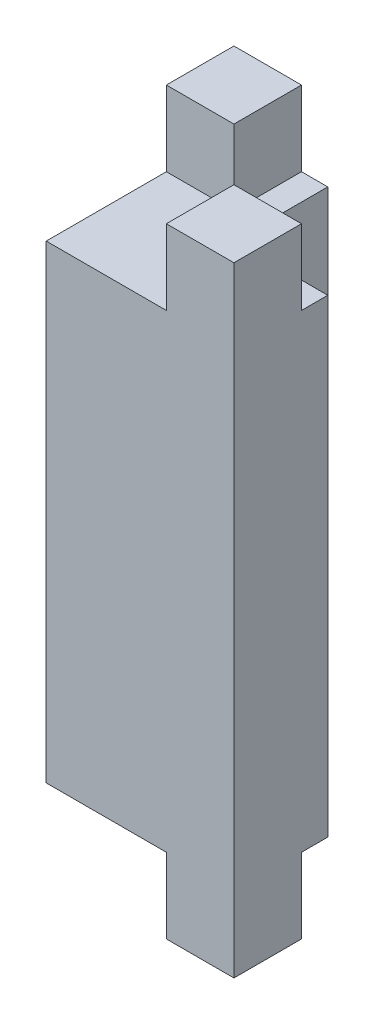
ISO-10303-21;
HEADER;
FILE_DESCRIPTION(('STEP AP214'),'2;1');
FILE_NAME('part.step','',(''),(''),'','','');
FILE_SCHEMA(('AUTOMOTIVE_DESIGN { 1 0 10303 214 1 1 1 1 }'));
ENDSEC;
DATA;
#1=APPLICATION_CONTEXT('core data for automotive mechanical design processes');
#2=APPLICATION_PROTOCOL_DEFINITION('international standard','automotive_design',2000,#1);
#3=PRODUCT_CONTEXT('',#1,'mechanical');
#4=PRODUCT('Part','Part','',(#3));
#5=PRODUCT_RELATED_PRODUCT_CATEGORY('part','',(#4));
#6=PRODUCT_DEFINITION_FORMATION('','',#4);
#7=PRODUCT_DEFINITION_CONTEXT('part definition',#1,'design');
#8=PRODUCT_DEFINITION('design','',#6,#7);
#9=PRODUCT_DEFINITION_SHAPE('','',#8);
#10=(LENGTH_UNIT() NAMED_UNIT(*) SI_UNIT(.MILLI.,.METRE.));
#11=(NAMED_UNIT(*) PLANE_ANGLE_UNIT() SI_UNIT($,.RADIAN.));
#12=(NAMED_UNIT(*) SI_UNIT($,.STERADIAN.) SOLID_ANGLE_UNIT());
#13=UNCERTAINTY_MEASURE_WITH_UNIT(LENGTH_MEASURE(1.E-05),#10,'distance_accuracy_value','');
#14=(GEOMETRIC_REPRESENTATION_CONTEXT(3) GLOBAL_UNCERTAINTY_ASSIGNED_CONTEXT((#13)) GLOBAL_UNIT_ASSIGNED_CONTEXT((#10,
#11,#12)) REPRESENTATION_CONTEXT('',''));
#15=CARTESIAN_POINT('',(0.,0.,0.));
#16=DIRECTION('',(0.,0.,1.));
#17=DIRECTION('',(1.,0.,0.));
#18=AXIS2_PLACEMENT_3D('',#15,#16,#17);
#19=CARTESIAN_POINT('',(0.,25.,0.));
#20=DIRECTION('',(0.,-1.,0.));
#21=DIRECTION('',(0.,0.,-1.));
#22=AXIS2_PLACEMENT_3D('',#19,#20,#21);
#23=PLANE('',#22);
#24=DIRECTION('',(-1.,0.,0.));
#25=VECTOR('',#24,1.);
#26=CARTESIAN_POINT('',(5.,25.,1.4));
#27=LINE('',#26,#25);
#28=CARTESIAN_POINT('',(5.,25.,1.4));
#29=VERTEX_POINT('',#28);
#30=CARTESIAN_POINT('',(1.4,25.,1.4));
#31=VERTEX_POINT('',#30);
#32=EDGE_CURVE('E181',#29,#31,#27,.T.);
#33=ORIENTED_EDGE('',*,*,#32,.F.);
#34=DIRECTION('',(0.,0.,-1.));
#35=VECTOR('',#34,1.);
#36=CARTESIAN_POINT('',(5.,25.,5.));
#37=LINE('',#36,#35);
#38=CARTESIAN_POINT('',(5.,25.,0.));
#39=VERTEX_POINT('',#38);
#40=EDGE_CURVE('E170',#29,#39,#37,.T.);
#41=ORIENTED_EDGE('',*,*,#40,.T.);
#42=DIRECTION('',(-1.,0.,0.));
#43=VECTOR('',#42,1.);
#44=CARTESIAN_POINT('',(0.,25.,0.));
#45=LINE('',#44,#43);
#46=CARTESIAN_POINT('',(0.,25.,0.));
#47=VERTEX_POINT('',#46);
#48=EDGE_CURVE('E179',#39,#47,#45,.T.);
#49=ORIENTED_EDGE('',*,*,#48,.T.);
#50=DIRECTION('',(0.,0.,-1.));
#51=VECTOR('',#50,1.);
#52=CARTESIAN_POINT('',(0.,25.,0.));
#53=LINE('',#52,#51);
#54=CARTESIAN_POINT('',(0.,25.,-5.));
#55=VERTEX_POINT('',#54);
#56=EDGE_CURVE('E325',#47,#55,#53,.T.);
#57=ORIENTED_EDGE('',*,*,#56,.T.);
#58=DIRECTION('',(-1.,0.,0.));
#59=VECTOR('',#58,1.);
#60=CARTESIAN_POINT('',(-5.,25.,-5.));
#61=LINE('',#60,#59);
#62=CARTESIAN_POINT('',(-1.4,25.,-5.));
#63=VERTEX_POINT('',#62);
#64=EDGE_CURVE('E328',#55,#63,#61,.T.);
#65=ORIENTED_EDGE('',*,*,#64,.T.);
#66=DIRECTION('',(0.,0.,-1.));
#67=VECTOR('',#66,1.);
#68=CARTESIAN_POINT('',(-1.4,25.,-5.));
#69=LINE('',#68,#67);
#70=CARTESIAN_POINT('',(-1.4,25.,-1.4));
#71=VERTEX_POINT('',#70);
#72=EDGE_CURVE('E186',#71,#63,#69,.T.);
#73=ORIENTED_EDGE('',*,*,#72,.F.);
#74=DIRECTION('',(1.,0.,0.));
#75=VECTOR('',#74,1.);
#76=CARTESIAN_POINT('',(-1.4,25.,-1.4));
#77=LINE('',#76,#75);
#78=CARTESIAN_POINT('',(-5.,25.,-1.4));
#79=VERTEX_POINT('',#78);
#80=EDGE_CURVE('E220',#79,#71,#77,.T.);
#81=ORIENTED_EDGE('',*,*,#80,.F.);
#82=DIRECTION('',(0.,0.,1.));
#83=VECTOR('',#82,1.);
#84=CARTESIAN_POINT('',(-5.,25.,5.));
#85=LINE('',#84,#83);
#86=CARTESIAN_POINT('',(-5.,25.,5.));
#87=VERTEX_POINT('',#86);
#88=EDGE_CURVE('E317',#79,#87,#85,.T.);
#89=ORIENTED_EDGE('',*,*,#88,.T.);
#90=DIRECTION('',(1.,0.,0.));
#91=VECTOR('',#90,1.);
#92=CARTESIAN_POINT('',(-5.,25.,5.));
#93=LINE('',#92,#91);
#94=CARTESIAN_POINT('',(1.4,25.,5.));
#95=VERTEX_POINT('',#94);
#96=EDGE_CURVE('E66',#87,#95,#93,.T.);
#97=ORIENTED_EDGE('',*,*,#96,.T.);
#98=DIRECTION('',(0.,0.,1.));
#99=VECTOR('',#98,1.);
#100=CARTESIAN_POINT('',(1.4,25.,1.4));
#101=LINE('',#100,#99);
#102=EDGE_CURVE('E61',#31,#95,#101,.T.);
#103=ORIENTED_EDGE('',*,*,#102,.F.);
#104=EDGE_LOOP('',(#33,#41,#49,#57,#65,#73,#81,#89,#97,#103));
#105=FACE_BOUND('',#104,.T.);
#106=ADVANCED_FACE('F45',(#105),#23,.F.);
#107=CARTESIAN_POINT('',(0.,0.,0.));
#108=DIRECTION('',(0.,-1.,0.));
#109=DIRECTION('',(0.,0.,-1.));
#110=AXIS2_PLACEMENT_3D('',#107,#108,#109);
#111=PLANE('',#110);
#112=DIRECTION('',(0.,0.,1.));
#113=VECTOR('',#112,1.);
#114=CARTESIAN_POINT('',(1.4,0.,1.4));
#115=LINE('',#114,#113);
#116=CARTESIAN_POINT('',(1.4,0.,1.4));
#117=VERTEX_POINT('',#116);
#118=CARTESIAN_POINT('',(1.4,0.,5.));
#119=VERTEX_POINT('',#118);
#120=EDGE_CURVE('E259',#117,#119,#115,.T.);
#121=ORIENTED_EDGE('',*,*,#120,.T.);
#122=DIRECTION('',(1.,0.,0.));
#123=VECTOR('',#122,1.);
#124=CARTESIAN_POINT('',(-5.,0.,5.));
#125=LINE('',#124,#123);
#126=CARTESIAN_POINT('',(-5.,0.,5.));
#127=VERTEX_POINT('',#126);
#128=EDGE_CURVE('E311',#127,#119,#125,.T.);
#129=ORIENTED_EDGE('',*,*,#128,.F.);
#130=DIRECTION('',(0.,0.,1.));
#131=VECTOR('',#130,1.);
#132=CARTESIAN_POINT('',(-5.,0.,0.));
#133=LINE('',#132,#131);
#134=CARTESIAN_POINT('',(-5.,0.,-1.4));
#135=VERTEX_POINT('',#134);
#136=EDGE_CURVE('E320',#135,#127,#133,.T.);
#137=ORIENTED_EDGE('',*,*,#136,.F.);
#138=DIRECTION('',(1.,0.,0.));
#139=VECTOR('',#138,1.);
#140=CARTESIAN_POINT('',(-1.4,0.,-1.40000000000001));
#141=LINE('',#140,#139);
#142=CARTESIAN_POINT('',(-1.4,0.,-1.40000000000001));
#143=VERTEX_POINT('',#142);
#144=EDGE_CURVE('E288',#135,#143,#141,.T.);
#145=ORIENTED_EDGE('',*,*,#144,.T.);
#146=DIRECTION('',(0.,0.,-1.));
#147=VECTOR('',#146,1.);
#148=CARTESIAN_POINT('',(-1.4,0.,-5.));
#149=LINE('',#148,#147);
#150=CARTESIAN_POINT('',(-1.4,0.,-5.));
#151=VERTEX_POINT('',#150);
#152=EDGE_CURVE('E268',#143,#151,#149,.T.);
#153=ORIENTED_EDGE('',*,*,#152,.T.);
#154=DIRECTION('',(-1.,0.,0.));
#155=VECTOR('',#154,1.);
#156=CARTESIAN_POINT('',(-5.,0.,-5.));
#157=LINE('',#156,#155);
#158=CARTESIAN_POINT('',(0.,0.,-5.));
#159=VERTEX_POINT('',#158);
#160=EDGE_CURVE('E344',#159,#151,#157,.T.);
#161=ORIENTED_EDGE('',*,*,#160,.F.);
#162=DIRECTION('',(0.,0.,-1.));
#163=VECTOR('',#162,1.);
#164=CARTESIAN_POINT('',(0.,0.,0.));
#165=LINE('',#164,#163);
#166=CARTESIAN_POINT('',(0.,0.,0.));
#167=VERTEX_POINT('',#166);
#168=EDGE_CURVE('E341',#167,#159,#165,.T.);
#169=ORIENTED_EDGE('',*,*,#168,.F.);
#170=DIRECTION('',(-1.,0.,0.));
#171=VECTOR('',#170,1.);
#172=CARTESIAN_POINT('',(0.,0.,0.));
#173=LINE('',#172,#171);
#174=CARTESIAN_POINT('',(5.,0.,0.));
#175=VERTEX_POINT('',#174);
#176=EDGE_CURVE('E338',#175,#167,#173,.T.);
#177=ORIENTED_EDGE('',*,*,#176,.F.);
#178=DIRECTION('',(0.,0.,-1.));
#179=VECTOR('',#178,1.);
#180=CARTESIAN_POINT('',(5.,0.,5.));
#181=LINE('',#180,#179);
#182=CARTESIAN_POINT('',(5.,0.,1.4));
#183=VERTEX_POINT('',#182);
#184=EDGE_CURVE('E335',#183,#175,#181,.T.);
#185=ORIENTED_EDGE('',*,*,#184,.F.);
#186=DIRECTION('',(-1.,0.,0.));
#187=VECTOR('',#186,1.);
#188=CARTESIAN_POINT('',(5.,0.,1.4));
#189=LINE('',#188,#187);
#190=EDGE_CURVE('E263',#183,#117,#189,.T.);
#191=ORIENTED_EDGE('',*,*,#190,.T.);
#192=EDGE_LOOP('',(#121,#129,#137,#145,#153,#161,#169,#177,#185,#191));
#193=FACE_BOUND('',#192,.T.);
#194=ADVANCED_FACE('F379',(#193),#111,.T.);
#195=CARTESIAN_POINT('',(-5.,25.,5.));
#196=DIRECTION('',(0.,0.,-1.));
#197=DIRECTION('',(-1.,0.,0.));
#198=AXIS2_PLACEMENT_3D('',#195,#196,#197);
#199=PLANE('',#198);
#200=ORIENTED_EDGE('',*,*,#128,.T.);
#201=DIRECTION('',(0.,1.,0.));
#202=VECTOR('',#201,1.);
#203=CARTESIAN_POINT('',(1.4,-4.,5.));
#204=LINE('',#203,#202);
#205=CARTESIAN_POINT('',(1.4,-4.,5.));
#206=VERTEX_POINT('',#205);
#207=EDGE_CURVE('E248',#206,#119,#204,.T.);
#208=ORIENTED_EDGE('',*,*,#207,.F.);
#209=DIRECTION('',(1.,0.,0.));
#210=VECTOR('',#209,1.);
#211=CARTESIAN_POINT('',(5.,-4.,5.));
#212=LINE('',#211,#210);
#213=CARTESIAN_POINT('',(5.,-4.,5.));
#214=VERTEX_POINT('',#213);
#215=EDGE_CURVE('E253',#206,#214,#212,.T.);
#216=ORIENTED_EDGE('',*,*,#215,.T.);
#217=DIRECTION('',(0.,-1.,0.));
#218=VECTOR('',#217,1.);
#219=CARTESIAN_POINT('',(5.,25.,5.));
#220=LINE('',#219,#218);
#221=CARTESIAN_POINT('',(5.,29.,5.));
#222=VERTEX_POINT('',#221);
#223=EDGE_CURVE('E54',#222,#214,#220,.T.);
#224=ORIENTED_EDGE('',*,*,#223,.F.);
#225=DIRECTION('',(1.,0.,0.));
#226=VECTOR('',#225,1.);
#227=CARTESIAN_POINT('',(5.,29.,5.));
#228=LINE('',#227,#226);
#229=CARTESIAN_POINT('',(1.4,29.,5.00000000000001));
#230=VERTEX_POINT('',#229);
#231=EDGE_CURVE('E201',#230,#222,#228,.T.);
#232=ORIENTED_EDGE('',*,*,#231,.F.);
#233=DIRECTION('',(0.,-1.,0.));
#234=VECTOR('',#233,1.);
#235=CARTESIAN_POINT('',(1.4,29.,5.00000000000001));
#236=LINE('',#235,#234);
#237=EDGE_CURVE('E195',#230,#95,#236,.T.);
#238=ORIENTED_EDGE('',*,*,#237,.T.);
#239=ORIENTED_EDGE('',*,*,#96,.F.);
#240=DIRECTION('',(0.,-1.,0.));
#241=VECTOR('',#240,1.);
#242=CARTESIAN_POINT('',(-5.,25.,5.));
#243=LINE('',#242,#241);
#244=EDGE_CURVE('E11',#87,#127,#243,.T.);
#245=ORIENTED_EDGE('',*,*,#244,.T.);
#246=EDGE_LOOP('',(#200,#208,#216,#224,#232,#238,#239,#245));
#247=FACE_BOUND('',#246,.T.);
#248=ADVANCED_FACE('F47',(#247),#199,.F.);
#249=CARTESIAN_POINT('',(5.,25.,5.));
#250=DIRECTION('',(-1.,0.,0.));
#251=DIRECTION('',(0.,0.,1.));
#252=AXIS2_PLACEMENT_3D('',#249,#250,#251);
#253=PLANE('',#252);
#254=ORIENTED_EDGE('',*,*,#223,.T.);
#255=DIRECTION('',(0.,0.,-1.));
#256=VECTOR('',#255,1.);
#257=CARTESIAN_POINT('',(5.,-4.,1.4));
#258=LINE('',#257,#256);
#259=CARTESIAN_POINT('',(5.,-4.,1.4));
#260=VERTEX_POINT('',#259);
#261=EDGE_CURVE('E264',#214,#260,#258,.T.);
#262=ORIENTED_EDGE('',*,*,#261,.T.);
#263=DIRECTION('',(0.,1.,0.));
#264=VECTOR('',#263,1.);
#265=CARTESIAN_POINT('',(5.,-4.,1.4));
#266=LINE('',#265,#264);
#267=EDGE_CURVE('E249',#260,#183,#266,.T.);
#268=ORIENTED_EDGE('',*,*,#267,.T.);
#269=ORIENTED_EDGE('',*,*,#184,.T.);
#270=DIRECTION('',(0.,-1.,0.));
#271=VECTOR('',#270,1.);
#272=CARTESIAN_POINT('',(5.,25.,0.));
#273=LINE('',#272,#271);
#274=EDGE_CURVE('E176',#39,#175,#273,.T.);
#275=ORIENTED_EDGE('',*,*,#274,.F.);
#276=ORIENTED_EDGE('',*,*,#40,.F.);
#277=DIRECTION('',(0.,-1.,0.));
#278=VECTOR('',#277,1.);
#279=CARTESIAN_POINT('',(5.,29.,1.4));
#280=LINE('',#279,#278);
#281=CARTESIAN_POINT('',(5.,29.,1.4));
#282=VERTEX_POINT('',#281);
#283=EDGE_CURVE('E174',#282,#29,#280,.T.);
#284=ORIENTED_EDGE('',*,*,#283,.F.);
#285=DIRECTION('',(0.,0.,-1.));
#286=VECTOR('',#285,1.);
#287=CARTESIAN_POINT('',(5.,29.,1.4));
#288=LINE('',#287,#286);
#289=EDGE_CURVE('E203',#222,#282,#288,.T.);
#290=ORIENTED_EDGE('',*,*,#289,.F.);
#291=EDGE_LOOP('',(#254,#262,#268,#269,#275,#276,#284,#290));
#292=FACE_BOUND('',#291,.T.);
#293=ADVANCED_FACE('F171',(#292),#253,.F.);
#294=CARTESIAN_POINT('',(0.,25.,0.));
#295=DIRECTION('',(0.,0.,1.));
#296=DIRECTION('',(1.,0.,0.));
#297=AXIS2_PLACEMENT_3D('',#294,#295,#296);
#298=PLANE('',#297);
#299=ORIENTED_EDGE('',*,*,#176,.T.);
#300=DIRECTION('',(0.,-1.,0.));
#301=VECTOR('',#300,1.);
#302=CARTESIAN_POINT('',(0.,25.,0.));
#303=LINE('',#302,#301);
#304=EDGE_CURVE('E356',#47,#167,#303,.T.);
#305=ORIENTED_EDGE('',*,*,#304,.F.);
#306=ORIENTED_EDGE('',*,*,#48,.F.);
#307=ORIENTED_EDGE('',*,*,#274,.T.);
#308=EDGE_LOOP('',(#299,#305,#306,#307));
#309=FACE_BOUND('',#308,.T.);
#310=ADVANCED_FACE('F384',(#309),#298,.F.);
#311=CARTESIAN_POINT('',(0.,25.,0.));
#312=DIRECTION('',(-1.,0.,0.));
#313=DIRECTION('',(0.,0.,1.));
#314=AXIS2_PLACEMENT_3D('',#311,#312,#313);
#315=PLANE('',#314);
#316=ORIENTED_EDGE('',*,*,#168,.T.);
#317=DIRECTION('',(0.,-1.,0.));
#318=VECTOR('',#317,1.);
#319=CARTESIAN_POINT('',(0.,25.,-5.));
#320=LINE('',#319,#318);
#321=EDGE_CURVE('E352',#55,#159,#320,.T.);
#322=ORIENTED_EDGE('',*,*,#321,.F.);
#323=ORIENTED_EDGE('',*,*,#56,.F.);
#324=ORIENTED_EDGE('',*,*,#304,.T.);
#325=EDGE_LOOP('',(#316,#322,#323,#324));
#326=FACE_BOUND('',#325,.T.);
#327=ADVANCED_FACE('F387',(#326),#315,.F.);
#328=CARTESIAN_POINT('',(-5.,25.,-5.));
#329=DIRECTION('',(0.,0.,1.));
#330=DIRECTION('',(1.,0.,0.));
#331=AXIS2_PLACEMENT_3D('',#328,#329,#330);
#332=PLANE('',#331);
#333=ORIENTED_EDGE('',*,*,#160,.T.);
#334=DIRECTION('',(0.,1.,0.));
#335=VECTOR('',#334,1.);
#336=CARTESIAN_POINT('',(-1.4,-4.,-5.));
#337=LINE('',#336,#335);
#338=CARTESIAN_POINT('',(-1.4,-4.,-5.));
#339=VERTEX_POINT('',#338);
#340=EDGE_CURVE('E300',#339,#151,#337,.T.);
#341=ORIENTED_EDGE('',*,*,#340,.F.);
#342=DIRECTION('',(-1.,0.,0.));
#343=VECTOR('',#342,1.);
#344=CARTESIAN_POINT('',(-1.4,-4.,-5.));
#345=LINE('',#344,#343);
#346=CARTESIAN_POINT('',(-5.,-4.,-5.));
#347=VERTEX_POINT('',#346);
#348=EDGE_CURVE('E287',#339,#347,#345,.T.);
#349=ORIENTED_EDGE('',*,*,#348,.T.);
#350=DIRECTION('',(0.,-1.,0.));
#351=VECTOR('',#350,1.);
#352=CARTESIAN_POINT('',(-5.,25.,-5.));
#353=LINE('',#352,#351);
#354=CARTESIAN_POINT('',(-5.,29.,-5.));
#355=VERTEX_POINT('',#354);
#356=EDGE_CURVE('E331',#355,#347,#353,.T.);
#357=ORIENTED_EDGE('',*,*,#356,.F.);
#358=DIRECTION('',(-1.,0.,0.));
#359=VECTOR('',#358,1.);
#360=CARTESIAN_POINT('',(-1.4,29.,-5.));
#361=LINE('',#360,#359);
#362=CARTESIAN_POINT('',(-1.4,29.,-5.));
#363=VERTEX_POINT('',#362);
#364=EDGE_CURVE('E219',#363,#355,#361,.T.);
#365=ORIENTED_EDGE('',*,*,#364,.F.);
#366=DIRECTION('',(0.,-1.,0.));
#367=VECTOR('',#366,1.);
#368=CARTESIAN_POINT('',(-1.4,29.,-5.));
#369=LINE('',#368,#367);
#370=EDGE_CURVE('E244',#363,#63,#369,.T.);
#371=ORIENTED_EDGE('',*,*,#370,.T.);
#372=ORIENTED_EDGE('',*,*,#64,.F.);
#373=ORIENTED_EDGE('',*,*,#321,.T.);
#374=EDGE_LOOP('',(#333,#341,#349,#357,#365,#371,#372,#373));
#375=FACE_BOUND('',#374,.T.);
#376=ADVANCED_FACE('F392',(#375),#332,.F.);
#377=CARTESIAN_POINT('',(-5.,25.,0.));
#378=DIRECTION('',(1.,0.,0.));
#379=DIRECTION('',(0.,0.,-1.));
#380=AXIS2_PLACEMENT_3D('',#377,#378,#379);
#381=PLANE('',#380);
#382=ORIENTED_EDGE('',*,*,#356,.T.);
#383=DIRECTION('',(0.,0.,1.));
#384=VECTOR('',#383,1.);
#385=CARTESIAN_POINT('',(-5.,-4.,-5.));
#386=LINE('',#385,#384);
#387=CARTESIAN_POINT('',(-5.,-4.,-1.4));
#388=VERTEX_POINT('',#387);
#389=EDGE_CURVE('E292',#347,#388,#386,.T.);
#390=ORIENTED_EDGE('',*,*,#389,.T.);
#391=DIRECTION('',(0.,1.,0.));
#392=VECTOR('',#391,1.);
#393=CARTESIAN_POINT('',(-5.,-4.,-1.4));
#394=LINE('',#393,#392);
#395=EDGE_CURVE('E312',#388,#135,#394,.T.);
#396=ORIENTED_EDGE('',*,*,#395,.T.);
#397=ORIENTED_EDGE('',*,*,#136,.T.);
#398=ORIENTED_EDGE('',*,*,#244,.F.);
#399=ORIENTED_EDGE('',*,*,#88,.F.);
#400=DIRECTION('',(0.,-1.,0.));
#401=VECTOR('',#400,1.);
#402=CARTESIAN_POINT('',(-5.,29.,-1.4));
#403=LINE('',#402,#401);
#404=CARTESIAN_POINT('',(-5.,29.,-1.4));
#405=VERTEX_POINT('',#404);
#406=EDGE_CURVE('E240',#405,#79,#403,.T.);
#407=ORIENTED_EDGE('',*,*,#406,.F.);
#408=DIRECTION('',(0.,0.,1.));
#409=VECTOR('',#408,1.);
#410=CARTESIAN_POINT('',(-5.,29.,-5.));
#411=LINE('',#410,#409);
#412=EDGE_CURVE('E224',#355,#405,#411,.T.);
#413=ORIENTED_EDGE('',*,*,#412,.F.);
#414=EDGE_LOOP('',(#382,#390,#396,#397,#398,#399,#407,#413));
#415=FACE_BOUND('',#414,.T.);
#416=ADVANCED_FACE('F404',(#415),#381,.F.);
#417=CARTESIAN_POINT('',(-1.4,-4.,-5.));
#418=DIRECTION('',(1.,0.,0.));
#419=DIRECTION('',(0.,0.,-1.));
#420=AXIS2_PLACEMENT_3D('',#417,#418,#419);
#421=PLANE('',#420);
#422=ORIENTED_EDGE('',*,*,#152,.F.);
#423=DIRECTION('',(0.,1.,0.));
#424=VECTOR('',#423,1.);
#425=CARTESIAN_POINT('',(-1.4,-4.,-1.40000000000001));
#426=LINE('',#425,#424);
#427=CARTESIAN_POINT('',(-1.4,-4.,-1.40000000000001));
#428=VERTEX_POINT('',#427);
#429=EDGE_CURVE('E307',#428,#143,#426,.T.);
#430=ORIENTED_EDGE('',*,*,#429,.F.);
#431=DIRECTION('',(0.,0.,-1.));
#432=VECTOR('',#431,1.);
#433=CARTESIAN_POINT('',(-1.4,-4.,-5.));
#434=LINE('',#433,#432);
#435=EDGE_CURVE('E283',#428,#339,#434,.T.);
#436=ORIENTED_EDGE('',*,*,#435,.T.);
#437=ORIENTED_EDGE('',*,*,#340,.T.);
#438=EDGE_LOOP('',(#422,#430,#436,#437));
#439=FACE_BOUND('',#438,.T.);
#440=ADVANCED_FACE('F429',(#439),#421,.T.);
#441=CARTESIAN_POINT('',(-1.4,-4.,-1.40000000000001));
#442=DIRECTION('',(0.,0.,1.));
#443=DIRECTION('',(1.,0.,0.));
#444=AXIS2_PLACEMENT_3D('',#441,#442,#443);
#445=PLANE('',#444);
#446=ORIENTED_EDGE('',*,*,#144,.F.);
#447=ORIENTED_EDGE('',*,*,#395,.F.);
#448=DIRECTION('',(1.,0.,0.));
#449=VECTOR('',#448,1.);
#450=CARTESIAN_POINT('',(-1.4,-4.,-1.40000000000001));
#451=LINE('',#450,#449);
#452=EDGE_CURVE('E296',#388,#428,#451,.T.);
#453=ORIENTED_EDGE('',*,*,#452,.T.);
#454=ORIENTED_EDGE('',*,*,#429,.T.);
#455=EDGE_LOOP('',(#446,#447,#453,#454));
#456=FACE_BOUND('',#455,.T.);
#457=ADVANCED_FACE('F529',(#456),#445,.T.);
#458=CARTESIAN_POINT('',(0.,-4.,0.));
#459=DIRECTION('',(0.,-1.,0.));
#460=DIRECTION('',(0.,0.,-1.));
#461=AXIS2_PLACEMENT_3D('',#458,#459,#460);
#462=PLANE('',#461);
#463=ORIENTED_EDGE('',*,*,#435,.F.);
#464=ORIENTED_EDGE('',*,*,#452,.F.);
#465=ORIENTED_EDGE('',*,*,#389,.F.);
#466=ORIENTED_EDGE('',*,*,#348,.F.);
#467=EDGE_LOOP('',(#463,#464,#465,#466));
#468=FACE_BOUND('',#467,.T.);
#469=ADVANCED_FACE('F526',(#468),#462,.T.);
#470=CARTESIAN_POINT('',(1.4,-4.,1.4));
#471=DIRECTION('',(-1.,0.,0.));
#472=DIRECTION('',(0.,0.,1.));
#473=AXIS2_PLACEMENT_3D('',#470,#471,#472);
#474=PLANE('',#473);
#475=ORIENTED_EDGE('',*,*,#120,.F.);
#476=DIRECTION('',(0.,1.,0.));
#477=VECTOR('',#476,1.);
#478=CARTESIAN_POINT('',(1.4,-4.,1.4));
#479=LINE('',#478,#477);
#480=CARTESIAN_POINT('',(1.4,-4.,1.4));
#481=VERTEX_POINT('',#480);
#482=EDGE_CURVE('E254',#481,#117,#479,.T.);
#483=ORIENTED_EDGE('',*,*,#482,.F.);
#484=DIRECTION('',(0.,0.,1.));
#485=VECTOR('',#484,1.);
#486=CARTESIAN_POINT('',(1.4,-4.,1.4));
#487=LINE('',#486,#485);
#488=EDGE_CURVE('E272',#481,#206,#487,.T.);
#489=ORIENTED_EDGE('',*,*,#488,.T.);
#490=ORIENTED_EDGE('',*,*,#207,.T.);
#491=EDGE_LOOP('',(#475,#483,#489,#490));
#492=FACE_BOUND('',#491,.T.);
#493=ADVANCED_FACE('F373',(#492),#474,.T.);
#494=CARTESIAN_POINT('',(5.,-4.,1.4));
#495=DIRECTION('',(0.,0.,-1.));
#496=DIRECTION('',(-1.,0.,0.));
#497=AXIS2_PLACEMENT_3D('',#494,#495,#496);
#498=PLANE('',#497);
#499=ORIENTED_EDGE('',*,*,#190,.F.);
#500=ORIENTED_EDGE('',*,*,#267,.F.);
#501=DIRECTION('',(-1.,0.,0.));
#502=VECTOR('',#501,1.);
#503=CARTESIAN_POINT('',(5.,-4.,1.4));
#504=LINE('',#503,#502);
#505=EDGE_CURVE('E276',#260,#481,#504,.T.);
#506=ORIENTED_EDGE('',*,*,#505,.T.);
#507=ORIENTED_EDGE('',*,*,#482,.T.);
#508=EDGE_LOOP('',(#499,#500,#506,#507));
#509=FACE_BOUND('',#508,.T.);
#510=ADVANCED_FACE('F375',(#509),#498,.T.);
#511=CARTESIAN_POINT('',(0.,-4.,0.));
#512=DIRECTION('',(0.,-1.,0.));
#513=DIRECTION('',(0.,0.,-1.));
#514=AXIS2_PLACEMENT_3D('',#511,#512,#513);
#515=PLANE('',#514);
#516=ORIENTED_EDGE('',*,*,#261,.F.);
#517=ORIENTED_EDGE('',*,*,#215,.F.);
#518=ORIENTED_EDGE('',*,*,#488,.F.);
#519=ORIENTED_EDGE('',*,*,#505,.F.);
#520=EDGE_LOOP('',(#516,#517,#518,#519));
#521=FACE_BOUND('',#520,.T.);
#522=ADVANCED_FACE('F368',(#521),#515,.T.);
#523=CARTESIAN_POINT('',(-1.4,29.,-5.));
#524=DIRECTION('',(-1.,0.,0.));
#525=DIRECTION('',(0.,0.,1.));
#526=AXIS2_PLACEMENT_3D('',#523,#524,#525);
#527=PLANE('',#526);
#528=ORIENTED_EDGE('',*,*,#72,.T.);
#529=ORIENTED_EDGE('',*,*,#370,.F.);
#530=DIRECTION('',(0.,0.,-1.));
#531=VECTOR('',#530,1.);
#532=CARTESIAN_POINT('',(-1.4,29.,-5.));
#533=LINE('',#532,#531);
#534=CARTESIAN_POINT('',(-1.4,29.,-1.4));
#535=VERTEX_POINT('',#534);
#536=EDGE_CURVE('E215',#535,#363,#533,.T.);
#537=ORIENTED_EDGE('',*,*,#536,.F.);
#538=DIRECTION('',(0.,-1.,0.));
#539=VECTOR('',#538,1.);
#540=CARTESIAN_POINT('',(-1.4,29.,-1.4));
#541=LINE('',#540,#539);
#542=EDGE_CURVE('E230',#535,#71,#541,.T.);
#543=ORIENTED_EDGE('',*,*,#542,.T.);
#544=EDGE_LOOP('',(#528,#529,#537,#543));
#545=FACE_BOUND('',#544,.T.);
#546=ADVANCED_FACE('F395',(#545),#527,.F.);
#547=CARTESIAN_POINT('',(-1.4,29.,-1.4));
#548=DIRECTION('',(0.,0.,-1.));
#549=DIRECTION('',(-1.,0.,0.));
#550=AXIS2_PLACEMENT_3D('',#547,#548,#549);
#551=PLANE('',#550);
#552=ORIENTED_EDGE('',*,*,#80,.T.);
#553=ORIENTED_EDGE('',*,*,#542,.F.);
#554=DIRECTION('',(1.,0.,0.));
#555=VECTOR('',#554,1.);
#556=CARTESIAN_POINT('',(-1.4,29.,-1.4));
#557=LINE('',#556,#555);
#558=EDGE_CURVE('E227',#405,#535,#557,.T.);
#559=ORIENTED_EDGE('',*,*,#558,.F.);
#560=ORIENTED_EDGE('',*,*,#406,.T.);
#561=EDGE_LOOP('',(#552,#553,#559,#560));
#562=FACE_BOUND('',#561,.T.);
#563=ADVANCED_FACE('F399',(#562),#551,.F.);
#564=CARTESIAN_POINT('',(0.,29.,0.));
#565=DIRECTION('',(0.,-1.,0.));
#566=DIRECTION('',(0.,0.,-1.));
#567=AXIS2_PLACEMENT_3D('',#564,#565,#566);
#568=PLANE('',#567);
#569=ORIENTED_EDGE('',*,*,#536,.T.);
#570=ORIENTED_EDGE('',*,*,#364,.T.);
#571=ORIENTED_EDGE('',*,*,#412,.T.);
#572=ORIENTED_EDGE('',*,*,#558,.T.);
#573=EDGE_LOOP('',(#569,#570,#571,#572));
#574=FACE_BOUND('',#573,.T.);
#575=ADVANCED_FACE('F492',(#574),#568,.F.);
#576=CARTESIAN_POINT('',(5.,29.,1.4));
#577=DIRECTION('',(0.,0.,1.));
#578=DIRECTION('',(1.,0.,0.));
#579=AXIS2_PLACEMENT_3D('',#576,#577,#578);
#580=PLANE('',#579);
#581=ORIENTED_EDGE('',*,*,#32,.T.);
#582=DIRECTION('',(0.,-1.,0.));
#583=VECTOR('',#582,1.);
#584=CARTESIAN_POINT('',(1.4,29.,1.4));
#585=LINE('',#584,#583);
#586=CARTESIAN_POINT('',(1.4,29.,1.4));
#587=VERTEX_POINT('',#586);
#588=EDGE_CURVE('E192',#587,#31,#585,.T.);
#589=ORIENTED_EDGE('',*,*,#588,.F.);
#590=DIRECTION('',(-1.,0.,0.));
#591=VECTOR('',#590,1.);
#592=CARTESIAN_POINT('',(5.,29.,1.4));
#593=LINE('',#592,#591);
#594=EDGE_CURVE('E189',#282,#587,#593,.T.);
#595=ORIENTED_EDGE('',*,*,#594,.F.);
#596=ORIENTED_EDGE('',*,*,#283,.T.);
#597=EDGE_LOOP('',(#581,#589,#595,#596));
#598=FACE_BOUND('',#597,.T.);
#599=ADVANCED_FACE('F188',(#598),#580,.F.);
#600=CARTESIAN_POINT('',(1.4,29.,1.4));
#601=DIRECTION('',(1.,0.,0.));
#602=DIRECTION('',(0.,0.,-1.));
#603=AXIS2_PLACEMENT_3D('',#600,#601,#602);
#604=PLANE('',#603);
#605=ORIENTED_EDGE('',*,*,#102,.T.);
#606=ORIENTED_EDGE('',*,*,#237,.F.);
#607=DIRECTION('',(0.,0.,1.));
#608=VECTOR('',#607,1.);
#609=CARTESIAN_POINT('',(1.4,29.,1.4));
#610=LINE('',#609,#608);
#611=EDGE_CURVE('E208',#587,#230,#610,.T.);
#612=ORIENTED_EDGE('',*,*,#611,.F.);
#613=ORIENTED_EDGE('',*,*,#588,.T.);
#614=EDGE_LOOP('',(#605,#606,#612,#613));
#615=FACE_BOUND('',#614,.T.);
#616=ADVANCED_FACE('F410',(#615),#604,.F.);
#617=CARTESIAN_POINT('',(0.,29.,0.));
#618=DIRECTION('',(0.,-1.,0.));
#619=DIRECTION('',(0.,0.,-1.));
#620=AXIS2_PLACEMENT_3D('',#617,#618,#619);
#621=PLANE('',#620);
#622=ORIENTED_EDGE('',*,*,#289,.T.);
#623=ORIENTED_EDGE('',*,*,#594,.T.);
#624=ORIENTED_EDGE('',*,*,#611,.T.);
#625=ORIENTED_EDGE('',*,*,#231,.T.);
#626=EDGE_LOOP('',(#622,#623,#624,#625));
#627=FACE_BOUND('',#626,.T.);
#628=ADVANCED_FACE('F412',(#627),#621,.F.);
#629=CLOSED_SHELL('',(#106,#194,#248,#293,#310,#327,#376,#416,#440,#457,#469,#493,#510,#522,
#546,#563,#575,#599,#616,#628));
#630=MANIFOLD_SOLID_BREP('B2',#629);
#631=ADVANCED_BREP_SHAPE_REPRESENTATION('',(#18,#630),#14);
#632=SHAPE_DEFINITION_REPRESENTATION(#9,#631);
ENDSEC;
END-ISO-10303-21;
